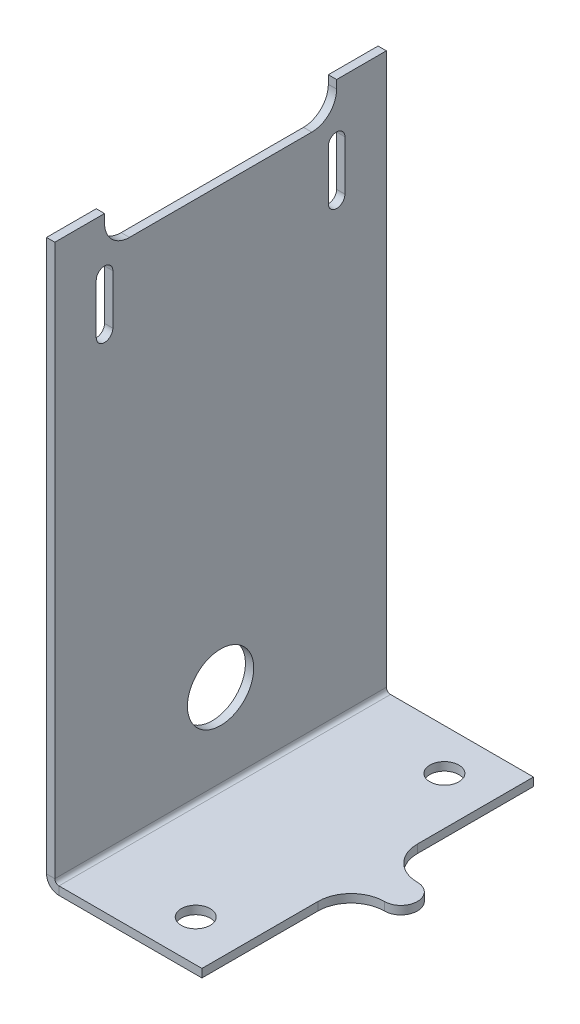
ISO-10303-21;
HEADER;
FILE_DESCRIPTION(('STEP AP214'),'2;1');
FILE_NAME('part.step','',(''),(''),'','','');
FILE_SCHEMA(('AUTOMOTIVE_DESIGN { 1 0 10303 214 1 1 1 1 }'));
ENDSEC;
DATA;
#1=APPLICATION_CONTEXT('core data for automotive mechanical design processes');
#2=APPLICATION_PROTOCOL_DEFINITION('international standard','automotive_design',2000,#1);
#3=PRODUCT_CONTEXT('',#1,'mechanical');
#4=PRODUCT('Part','Part','',(#3));
#5=PRODUCT_RELATED_PRODUCT_CATEGORY('part','',(#4));
#6=PRODUCT_DEFINITION_FORMATION('','',#4);
#7=PRODUCT_DEFINITION_CONTEXT('part definition',#1,'design');
#8=PRODUCT_DEFINITION('design','',#6,#7);
#9=PRODUCT_DEFINITION_SHAPE('','',#8);
#10=(LENGTH_UNIT() NAMED_UNIT(*) SI_UNIT(.MILLI.,.METRE.));
#11=(NAMED_UNIT(*) PLANE_ANGLE_UNIT() SI_UNIT($,.RADIAN.));
#12=(NAMED_UNIT(*) SI_UNIT($,.STERADIAN.) SOLID_ANGLE_UNIT());
#13=UNCERTAINTY_MEASURE_WITH_UNIT(LENGTH_MEASURE(1.E-05),#10,'distance_accuracy_value','');
#14=(GEOMETRIC_REPRESENTATION_CONTEXT(3) GLOBAL_UNCERTAINTY_ASSIGNED_CONTEXT((#13)) GLOBAL_UNIT_ASSIGNED_CONTEXT((#10,
#11,#12)) REPRESENTATION_CONTEXT('',''));
#15=CARTESIAN_POINT('',(0.,0.,0.));
#16=DIRECTION('',(0.,0.,1.));
#17=DIRECTION('',(1.,0.,0.));
#18=AXIS2_PLACEMENT_3D('',#15,#16,#17);
#19=CARTESIAN_POINT('',(37.30725,33.3375,0.));
#20=DIRECTION('',(-1.,0.,0.));
#21=DIRECTION('',(0.,0.,1.));
#22=AXIS2_PLACEMENT_3D('',#19,#20,#21);
#23=CYLINDRICAL_SURFACE('',#22,12.7);
#24=CARTESIAN_POINT('',(-41.275,33.3375,0.));
#25=DIRECTION('',(-1.,0.,0.));
#26=DIRECTION('',(0.,0.,1.));
#27=AXIS2_PLACEMENT_3D('',#24,#25,#26);
#28=CIRCLE('',#27,12.7);
#29=CARTESIAN_POINT('',(-41.275,33.3375,12.7));
#30=VERTEX_POINT('',#29);
#31=EDGE_CURVE('E384',#30,#30,#28,.T.);
#32=ORIENTED_EDGE('',*,*,#31,.T.);
#33=EDGE_LOOP('',(#32));
#34=FACE_BOUND('',#33,.T.);
#35=CARTESIAN_POINT('',(-38.1000000000002,33.3375,0.));
#36=DIRECTION('',(-1.,0.,0.));
#37=DIRECTION('',(0.,-1.,0.));
#38=AXIS2_PLACEMENT_3D('',#35,#36,#37);
#39=CIRCLE('',#38,12.7);
#40=CARTESIAN_POINT('',(-38.1000000000002,20.6375,0.));
#41=VERTEX_POINT('',#40);
#42=EDGE_CURVE('E326',#41,#41,#39,.F.);
#43=ORIENTED_EDGE('',*,*,#42,.T.);
#44=EDGE_LOOP('',(#43));
#45=FACE_BOUND('',#44,.T.);
#46=ADVANCED_FACE('F30',(#34,#45),#23,.F.);
#47=CARTESIAN_POINT('',(37.30725,173.101,-44.4499999999998));
#48=DIRECTION('',(-1.,0.,0.));
#49=DIRECTION('',(0.,0.,1.));
#50=AXIS2_PLACEMENT_3D('',#47,#48,#49);
#51=CYLINDRICAL_SURFACE('',#50,3.175);
#52=CARTESIAN_POINT('',(-38.1000000000002,173.101,-44.4499999999998));
#53=DIRECTION('',(-1.,0.,0.));
#54=DIRECTION('',(0.,-1.,0.));
#55=AXIS2_PLACEMENT_3D('',#52,#53,#54);
#56=CIRCLE('',#55,3.175);
#57=CARTESIAN_POINT('',(-38.1000000000002,173.101,-41.2749999999998));
#58=VERTEX_POINT('',#57);
#59=CARTESIAN_POINT('',(-38.1000000000002,173.101,-47.6249999999999));
#60=VERTEX_POINT('',#59);
#61=EDGE_CURVE('E323',#58,#60,#56,.F.);
#62=ORIENTED_EDGE('',*,*,#61,.T.);
#63=DIRECTION('',(-1.,0.,0.));
#64=VECTOR('',#63,1.);
#65=CARTESIAN_POINT('',(37.30725,173.101,-47.6249999999998));
#66=LINE('',#65,#64);
#67=CARTESIAN_POINT('',(-41.275,173.101,-47.6249999999998));
#68=VERTEX_POINT('',#67);
#69=EDGE_CURVE('E414',#60,#68,#66,.T.);
#70=ORIENTED_EDGE('',*,*,#69,.T.);
#71=CARTESIAN_POINT('',(-41.275,173.101,-44.4499999999998));
#72=DIRECTION('',(-1.,0.,0.));
#73=DIRECTION('',(0.,0.,1.));
#74=AXIS2_PLACEMENT_3D('',#71,#72,#73);
#75=CIRCLE('',#74,3.175);
#76=CARTESIAN_POINT('',(-41.275,173.101,-41.2749999999998));
#77=VERTEX_POINT('',#76);
#78=EDGE_CURVE('E381',#68,#77,#75,.T.);
#79=ORIENTED_EDGE('',*,*,#78,.T.);
#80=DIRECTION('',(-1.,0.,0.));
#81=VECTOR('',#80,1.);
#82=CARTESIAN_POINT('',(37.30725,173.101,-41.2749999999998));
#83=LINE('',#82,#81);
#84=EDGE_CURVE('E420',#58,#77,#83,.T.);
#85=ORIENTED_EDGE('',*,*,#84,.F.);
#86=EDGE_LOOP('',(#62,#70,#79,#85));
#87=FACE_BOUND('',#86,.T.);
#88=ADVANCED_FACE('F508',(#87),#51,.F.);
#89=CARTESIAN_POINT('',(37.30725,173.101,-41.2749999999998));
#90=DIRECTION('',(0.,0.,1.));
#91=DIRECTION('',(0.,-1.,0.));
#92=AXIS2_PLACEMENT_3D('',#89,#90,#91);
#93=PLANE('',#92);
#94=DIRECTION('',(0.,-1.,0.));
#95=VECTOR('',#94,1.);
#96=CARTESIAN_POINT('',(-38.1000000000002,173.101,-41.2749999999998));
#97=LINE('',#96,#95);
#98=CARTESIAN_POINT('',(-38.1000000000002,192.151,-41.2749999999998));
#99=VERTEX_POINT('',#98);
#100=EDGE_CURVE('E315',#99,#58,#97,.T.);
#101=ORIENTED_EDGE('',*,*,#100,.T.);
#102=ORIENTED_EDGE('',*,*,#84,.T.);
#103=DIRECTION('',(0.,1.,0.));
#104=VECTOR('',#103,1.);
#105=CARTESIAN_POINT('',(-41.275,173.101,-41.2749999999998));
#106=LINE('',#105,#104);
#107=CARTESIAN_POINT('',(-41.275,192.151,-41.2749999999998));
#108=VERTEX_POINT('',#107);
#109=EDGE_CURVE('E378',#77,#108,#106,.T.);
#110=ORIENTED_EDGE('',*,*,#109,.T.);
#111=DIRECTION('',(-1.,0.,0.));
#112=VECTOR('',#111,1.);
#113=CARTESIAN_POINT('',(37.30725,192.151,-41.2749999999998));
#114=LINE('',#113,#112);
#115=EDGE_CURVE('E417',#99,#108,#114,.T.);
#116=ORIENTED_EDGE('',*,*,#115,.F.);
#117=EDGE_LOOP('',(#101,#102,#110,#116));
#118=FACE_BOUND('',#117,.T.);
#119=ADVANCED_FACE('F504',(#118),#93,.F.);
#120=CARTESIAN_POINT('',(37.30725,192.151,-44.4499999999998));
#121=DIRECTION('',(-1.,0.,0.));
#122=DIRECTION('',(0.,0.,1.));
#123=AXIS2_PLACEMENT_3D('',#120,#121,#122);
#124=CYLINDRICAL_SURFACE('',#123,3.17500000000001);
#125=CARTESIAN_POINT('',(-38.1000000000002,192.151,-44.4499999999998));
#126=DIRECTION('',(-1.,0.,0.));
#127=DIRECTION('',(0.,-1.,0.));
#128=AXIS2_PLACEMENT_3D('',#125,#126,#127);
#129=CIRCLE('',#128,3.17500000000001);
#130=CARTESIAN_POINT('',(-38.1000000000002,192.151,-47.6249999999998));
#131=VERTEX_POINT('',#130);
#132=EDGE_CURVE('E317',#131,#99,#129,.F.);
#133=ORIENTED_EDGE('',*,*,#132,.T.);
#134=ORIENTED_EDGE('',*,*,#115,.T.);
#135=CARTESIAN_POINT('',(-41.275,192.151,-44.4499999999998));
#136=DIRECTION('',(-1.,0.,0.));
#137=DIRECTION('',(0.,0.,1.));
#138=AXIS2_PLACEMENT_3D('',#135,#136,#137);
#139=CIRCLE('',#138,3.17500000000001);
#140=CARTESIAN_POINT('',(-41.275,192.151,-47.6249999999999));
#141=VERTEX_POINT('',#140);
#142=EDGE_CURVE('E375',#108,#141,#139,.T.);
#143=ORIENTED_EDGE('',*,*,#142,.T.);
#144=DIRECTION('',(-1.,0.,0.));
#145=VECTOR('',#144,1.);
#146=CARTESIAN_POINT('',(37.30725,192.151,-47.6249999999998));
#147=LINE('',#146,#145);
#148=EDGE_CURVE('E411',#131,#141,#147,.T.);
#149=ORIENTED_EDGE('',*,*,#148,.F.);
#150=EDGE_LOOP('',(#133,#134,#143,#149));
#151=FACE_BOUND('',#150,.T.);
#152=ADVANCED_FACE('F500',(#151),#124,.F.);
#153=CARTESIAN_POINT('',(37.30725,192.151,-47.6249999999998));
#154=DIRECTION('',(0.,0.,-1.));
#155=DIRECTION('',(0.,1.,0.));
#156=AXIS2_PLACEMENT_3D('',#153,#154,#155);
#157=PLANE('',#156);
#158=DIRECTION('',(0.,1.,0.));
#159=VECTOR('',#158,1.);
#160=CARTESIAN_POINT('',(-38.1000000000002,192.151,-47.6249999999998));
#161=LINE('',#160,#159);
#162=EDGE_CURVE('E320',#60,#131,#161,.T.);
#163=ORIENTED_EDGE('',*,*,#162,.T.);
#164=ORIENTED_EDGE('',*,*,#148,.T.);
#165=DIRECTION('',(0.,-1.,0.));
#166=VECTOR('',#165,1.);
#167=CARTESIAN_POINT('',(-41.275,192.151,-47.6249999999998));
#168=LINE('',#167,#166);
#169=EDGE_CURVE('E373',#141,#68,#168,.T.);
#170=ORIENTED_EDGE('',*,*,#169,.T.);
#171=ORIENTED_EDGE('',*,*,#69,.F.);
#172=EDGE_LOOP('',(#163,#164,#170,#171));
#173=FACE_BOUND('',#172,.T.);
#174=ADVANCED_FACE('F496',(#173),#157,.F.);
#175=CARTESIAN_POINT('',(-41.275,1.58750000000013,287.45709349463));
#176=DIRECTION('',(1.,0.,0.));
#177=DIRECTION('',(0.,0.,-1.));
#178=AXIS2_PLACEMENT_3D('',#175,#176,#177);
#179=PLANE('',#178);
#180=DIRECTION('',(0.,1.,0.));
#181=VECTOR('',#180,1.);
#182=CARTESIAN_POINT('',(-41.275,173.101,47.6250000000002));
#183=LINE('',#182,#181);
#184=CARTESIAN_POINT('',(-41.275,173.101,47.6250000000001));
#185=VERTEX_POINT('',#184);
#186=CARTESIAN_POINT('',(-41.275,192.151,47.6250000000002));
#187=VERTEX_POINT('',#186);
#188=EDGE_CURVE('E367',#185,#187,#183,.T.);
#189=ORIENTED_EDGE('',*,*,#188,.F.);
#190=CARTESIAN_POINT('',(-41.275,173.101,44.4500000000001));
#191=DIRECTION('',(-1.,0.,0.));
#192=DIRECTION('',(0.,0.,1.));
#193=AXIS2_PLACEMENT_3D('',#190,#191,#192);
#194=CIRCLE('',#193,3.17500000000001);
#195=CARTESIAN_POINT('',(-41.275,173.101,41.2750000000001));
#196=VERTEX_POINT('',#195);
#197=EDGE_CURVE('E370',#196,#185,#194,.T.);
#198=ORIENTED_EDGE('',*,*,#197,.F.);
#199=DIRECTION('',(0.,-1.,0.));
#200=VECTOR('',#199,1.);
#201=CARTESIAN_POINT('',(-41.275,192.151,41.2750000000001));
#202=LINE('',#201,#200);
#203=CARTESIAN_POINT('',(-41.275,192.151,41.2750000000001));
#204=VERTEX_POINT('',#203);
#205=EDGE_CURVE('E355',#204,#196,#202,.T.);
#206=ORIENTED_EDGE('',*,*,#205,.F.);
#207=CARTESIAN_POINT('',(-41.275,192.151,44.4500000000002));
#208=DIRECTION('',(-1.,0.,0.));
#209=DIRECTION('',(0.,0.,1.));
#210=AXIS2_PLACEMENT_3D('',#207,#208,#209);
#211=CIRCLE('',#210,3.17500000000001);
#212=EDGE_CURVE('E362',#187,#204,#211,.T.);
#213=ORIENTED_EDGE('',*,*,#212,.F.);
#214=EDGE_LOOP('',(#189,#198,#206,#213));
#215=FACE_BOUND('',#214,.T.);
#216=ORIENTED_EDGE('',*,*,#169,.F.);
#217=ORIENTED_EDGE('',*,*,#142,.F.);
#218=ORIENTED_EDGE('',*,*,#109,.F.);
#219=ORIENTED_EDGE('',*,*,#78,.F.);
#220=EDGE_LOOP('',(#216,#217,#218,#219));
#221=FACE_BOUND('',#220,.T.);
#222=ORIENTED_EDGE('',*,*,#31,.F.);
#223=EDGE_LOOP('',(#222));
#224=FACE_BOUND('',#223,.T.);
#225=DIRECTION('',(0.,0.,-1.));
#226=VECTOR('',#225,1.);
#227=CARTESIAN_POINT('',(-41.275,212.725,287.45709349463));
#228=LINE('',#227,#226);
#229=CARTESIAN_POINT('',(-41.2749999999997,212.725,63.4999999999995));
#230=VERTEX_POINT('',#229);
#231=CARTESIAN_POINT('',(-41.275,212.725,44.45));
#232=VERTEX_POINT('',#231);
#233=EDGE_CURVE('E387',#230,#232,#228,.T.);
#234=ORIENTED_EDGE('',*,*,#233,.T.);
#235=DIRECTION('',(0.,-1.,0.));
#236=VECTOR('',#235,1.);
#237=CARTESIAN_POINT('',(-41.275,212.725,44.45));
#238=LINE('',#237,#236);
#239=CARTESIAN_POINT('',(-41.275,209.55,44.45));
#240=VERTEX_POINT('',#239);
#241=EDGE_CURVE('E390',#232,#240,#238,.T.);
#242=ORIENTED_EDGE('',*,*,#241,.T.);
#243=CARTESIAN_POINT('',(-41.275,209.55,34.925));
#244=DIRECTION('',(1.,0.,0.));
#245=DIRECTION('',(0.,0.,-1.));
#246=AXIS2_PLACEMENT_3D('',#243,#244,#245);
#247=CIRCLE('',#246,9.525);
#248=CARTESIAN_POINT('',(-41.275,200.025,34.925));
#249=VERTEX_POINT('',#248);
#250=EDGE_CURVE('E394',#240,#249,#247,.T.);
#251=ORIENTED_EDGE('',*,*,#250,.T.);
#252=DIRECTION('',(0.,0.,-1.));
#253=VECTOR('',#252,1.);
#254=CARTESIAN_POINT('',(-41.275,200.025,44.45));
#255=LINE('',#254,#253);
#256=CARTESIAN_POINT('',(-41.275,200.025,-34.925));
#257=VERTEX_POINT('',#256);
#258=EDGE_CURVE('E397',#249,#257,#255,.T.);
#259=ORIENTED_EDGE('',*,*,#258,.T.);
#260=CARTESIAN_POINT('',(-41.275,209.55,-34.925));
#261=DIRECTION('',(1.,0.,0.));
#262=DIRECTION('',(0.,0.,-1.));
#263=AXIS2_PLACEMENT_3D('',#260,#261,#262);
#264=CIRCLE('',#263,9.525);
#265=CARTESIAN_POINT('',(-41.275,209.55,-44.45));
#266=VERTEX_POINT('',#265);
#267=EDGE_CURVE('E400',#257,#266,#264,.T.);
#268=ORIENTED_EDGE('',*,*,#267,.T.);
#269=DIRECTION('',(0.,1.,0.));
#270=VECTOR('',#269,1.);
#271=CARTESIAN_POINT('',(-41.275,200.025,-44.45));
#272=LINE('',#271,#270);
#273=CARTESIAN_POINT('',(-41.275,212.725,-44.45));
#274=VERTEX_POINT('',#273);
#275=EDGE_CURVE('E45',#266,#274,#272,.T.);
#276=ORIENTED_EDGE('',*,*,#275,.T.);
#277=CARTESIAN_POINT('',(-41.275,212.725,-63.5000000000005));
#278=VERTEX_POINT('',#277);
#279=EDGE_CURVE('E391',#274,#278,#228,.T.);
#280=ORIENTED_EDGE('',*,*,#279,.T.);
#281=DIRECTION('',(0.,1.,0.));
#282=VECTOR('',#281,1.);
#283=CARTESIAN_POINT('',(-41.275,1.58750000000064,-63.5));
#284=LINE('',#283,#282);
#285=CARTESIAN_POINT('',(-41.2750000000001,1.58750000000013,-63.5000000000001));
#286=VERTEX_POINT('',#285);
#287=EDGE_CURVE('E404',#286,#278,#284,.T.);
#288=ORIENTED_EDGE('',*,*,#287,.F.);
#289=DIRECTION('',(0.,0.,-1.));
#290=VECTOR('',#289,1.);
#291=CARTESIAN_POINT('',(-41.275,1.58750000000013,287.45709349463));
#292=LINE('',#291,#290);
#293=CARTESIAN_POINT('',(-41.2750000000001,1.58750000000013,63.5));
#294=VERTEX_POINT('',#293);
#295=EDGE_CURVE('E226',#294,#286,#292,.T.);
#296=ORIENTED_EDGE('',*,*,#295,.F.);
#297=DIRECTION('',(0.,1.,0.));
#298=VECTOR('',#297,1.);
#299=CARTESIAN_POINT('',(-41.275,1.58749999999962,63.5));
#300=LINE('',#299,#298);
#301=EDGE_CURVE('E408',#294,#230,#300,.T.);
#302=ORIENTED_EDGE('',*,*,#301,.T.);
#303=EDGE_LOOP('',(#234,#242,#251,#259,#268,#276,#280,#288,#296,#302));
#304=FACE_BOUND('',#303,.T.);
#305=ADVANCED_FACE('F449',(#215,#221,#224,#304),#179,.F.);
#306=CARTESIAN_POINT('',(37.30725,173.101,44.4500000000001));
#307=DIRECTION('',(-1.,0.,0.));
#308=DIRECTION('',(0.,0.,1.));
#309=AXIS2_PLACEMENT_3D('',#306,#307,#308);
#310=CYLINDRICAL_SURFACE('',#309,3.17500000000001);
#311=CARTESIAN_POINT('',(-38.1000000000002,173.101,44.4500000000001));
#312=DIRECTION('',(-1.,0.,0.));
#313=DIRECTION('',(0.,-1.,0.));
#314=AXIS2_PLACEMENT_3D('',#311,#312,#313);
#315=CIRCLE('',#314,3.17500000000001);
#316=CARTESIAN_POINT('',(-38.1000000000002,173.101,47.6250000000002));
#317=VERTEX_POINT('',#316);
#318=CARTESIAN_POINT('',(-38.1000000000002,173.101,41.2750000000001));
#319=VERTEX_POINT('',#318);
#320=EDGE_CURVE('E306',#317,#319,#315,.F.);
#321=ORIENTED_EDGE('',*,*,#320,.T.);
#322=DIRECTION('',(-1.,0.,0.));
#323=VECTOR('',#322,1.);
#324=CARTESIAN_POINT('',(37.30725,173.101,41.2750000000001));
#325=LINE('',#324,#323);
#326=EDGE_CURVE('E357',#319,#196,#325,.T.);
#327=ORIENTED_EDGE('',*,*,#326,.T.);
#328=ORIENTED_EDGE('',*,*,#197,.T.);
#329=DIRECTION('',(-1.,0.,0.));
#330=VECTOR('',#329,1.);
#331=CARTESIAN_POINT('',(37.30725,173.101,47.6250000000002));
#332=LINE('',#331,#330);
#333=EDGE_CURVE('E365',#317,#185,#332,.T.);
#334=ORIENTED_EDGE('',*,*,#333,.F.);
#335=EDGE_LOOP('',(#321,#327,#328,#334));
#336=FACE_BOUND('',#335,.T.);
#337=ADVANCED_FACE('F489',(#336),#310,.F.);
#338=CARTESIAN_POINT('',(37.30725,173.101,47.6250000000002));
#339=DIRECTION('',(0.,0.,1.));
#340=DIRECTION('',(0.,-1.,0.));
#341=AXIS2_PLACEMENT_3D('',#338,#339,#340);
#342=PLANE('',#341);
#343=DIRECTION('',(0.,-1.,0.));
#344=VECTOR('',#343,1.);
#345=CARTESIAN_POINT('',(-38.1000000000002,173.101,47.6250000000002));
#346=LINE('',#345,#344);
#347=CARTESIAN_POINT('',(-38.1000000000002,192.151,47.6250000000002));
#348=VERTEX_POINT('',#347);
#349=EDGE_CURVE('E309',#348,#317,#346,.T.);
#350=ORIENTED_EDGE('',*,*,#349,.T.);
#351=ORIENTED_EDGE('',*,*,#333,.T.);
#352=ORIENTED_EDGE('',*,*,#188,.T.);
#353=DIRECTION('',(-1.,0.,0.));
#354=VECTOR('',#353,1.);
#355=CARTESIAN_POINT('',(37.30725,192.151,47.6250000000002));
#356=LINE('',#355,#354);
#357=EDGE_CURVE('E360',#348,#187,#356,.T.);
#358=ORIENTED_EDGE('',*,*,#357,.F.);
#359=EDGE_LOOP('',(#350,#351,#352,#358));
#360=FACE_BOUND('',#359,.T.);
#361=ADVANCED_FACE('F485',(#360),#342,.F.);
#362=CARTESIAN_POINT('',(37.30725,192.151,44.4500000000002));
#363=DIRECTION('',(-1.,0.,0.));
#364=DIRECTION('',(0.,0.,1.));
#365=AXIS2_PLACEMENT_3D('',#362,#363,#364);
#366=CYLINDRICAL_SURFACE('',#365,3.17500000000001);
#367=CARTESIAN_POINT('',(-38.1000000000002,192.151,44.4500000000002));
#368=DIRECTION('',(-1.,0.,0.));
#369=DIRECTION('',(0.,-1.,0.));
#370=AXIS2_PLACEMENT_3D('',#367,#368,#369);
#371=CIRCLE('',#370,3.17500000000001);
#372=CARTESIAN_POINT('',(-38.1000000000002,192.151,41.2750000000001));
#373=VERTEX_POINT('',#372);
#374=EDGE_CURVE('E312',#373,#348,#371,.F.);
#375=ORIENTED_EDGE('',*,*,#374,.T.);
#376=ORIENTED_EDGE('',*,*,#357,.T.);
#377=ORIENTED_EDGE('',*,*,#212,.T.);
#378=DIRECTION('',(-1.,0.,0.));
#379=VECTOR('',#378,1.);
#380=CARTESIAN_POINT('',(37.30725,192.151,41.2750000000001));
#381=LINE('',#380,#379);
#382=EDGE_CURVE('E353',#373,#204,#381,.T.);
#383=ORIENTED_EDGE('',*,*,#382,.F.);
#384=EDGE_LOOP('',(#375,#376,#377,#383));
#385=FACE_BOUND('',#384,.T.);
#386=ADVANCED_FACE('F476',(#385),#366,.F.);
#387=CARTESIAN_POINT('',(37.30725,192.151,41.2750000000001));
#388=DIRECTION('',(0.,0.,-1.));
#389=DIRECTION('',(0.,1.,0.));
#390=AXIS2_PLACEMENT_3D('',#387,#388,#389);
#391=PLANE('',#390);
#392=DIRECTION('',(0.,1.,0.));
#393=VECTOR('',#392,1.);
#394=CARTESIAN_POINT('',(-38.1000000000002,192.151,41.2750000000001));
#395=LINE('',#394,#393);
#396=EDGE_CURVE('E304',#319,#373,#395,.T.);
#397=ORIENTED_EDGE('',*,*,#396,.T.);
#398=ORIENTED_EDGE('',*,*,#382,.T.);
#399=ORIENTED_EDGE('',*,*,#205,.T.);
#400=ORIENTED_EDGE('',*,*,#326,.F.);
#401=EDGE_LOOP('',(#397,#398,#399,#400));
#402=FACE_BOUND('',#401,.T.);
#403=ADVANCED_FACE('F470',(#402),#391,.F.);
#404=CARTESIAN_POINT('',(-38.1000000000002,212.725,287.45709349463));
#405=DIRECTION('',(-1.,0.,0.));
#406=DIRECTION('',(0.,-1.,0.));
#407=AXIS2_PLACEMENT_3D('',#404,#405,#406);
#408=PLANE('',#407);
#409=ORIENTED_EDGE('',*,*,#396,.F.);
#410=ORIENTED_EDGE('',*,*,#320,.F.);
#411=ORIENTED_EDGE('',*,*,#349,.F.);
#412=ORIENTED_EDGE('',*,*,#374,.F.);
#413=EDGE_LOOP('',(#409,#410,#411,#412));
#414=FACE_BOUND('',#413,.T.);
#415=ORIENTED_EDGE('',*,*,#100,.F.);
#416=ORIENTED_EDGE('',*,*,#132,.F.);
#417=ORIENTED_EDGE('',*,*,#162,.F.);
#418=ORIENTED_EDGE('',*,*,#61,.F.);
#419=EDGE_LOOP('',(#415,#416,#417,#418));
#420=FACE_BOUND('',#419,.T.);
#421=ORIENTED_EDGE('',*,*,#42,.F.);
#422=EDGE_LOOP('',(#421));
#423=FACE_BOUND('',#422,.T.);
#424=DIRECTION('',(0.,-1.,0.));
#425=VECTOR('',#424,1.);
#426=CARTESIAN_POINT('',(-38.1000000000002,212.725,-44.45));
#427=LINE('',#426,#425);
#428=CARTESIAN_POINT('',(-38.1000000000002,212.725,-44.45));
#429=VERTEX_POINT('',#428);
#430=CARTESIAN_POINT('',(-38.1000000000002,209.55,-44.45));
#431=VERTEX_POINT('',#430);
#432=EDGE_CURVE('E329',#429,#431,#427,.T.);
#433=ORIENTED_EDGE('',*,*,#432,.T.);
#434=CARTESIAN_POINT('',(-38.1000000000002,209.55,-34.925));
#435=DIRECTION('',(-1.,0.,0.));
#436=DIRECTION('',(0.,-1.,0.));
#437=AXIS2_PLACEMENT_3D('',#434,#435,#436);
#438=CIRCLE('',#437,9.525);
#439=CARTESIAN_POINT('',(-38.1000000000002,200.025,-34.925));
#440=VERTEX_POINT('',#439);
#441=EDGE_CURVE('E51',#431,#440,#438,.T.);
#442=ORIENTED_EDGE('',*,*,#441,.T.);
#443=DIRECTION('',(0.,0.,1.));
#444=VECTOR('',#443,1.);
#445=CARTESIAN_POINT('',(-38.1000000000002,200.025,287.45709349463));
#446=LINE('',#445,#444);
#447=CARTESIAN_POINT('',(-38.1000000000002,200.025,34.925));
#448=VERTEX_POINT('',#447);
#449=EDGE_CURVE('E333',#440,#448,#446,.T.);
#450=ORIENTED_EDGE('',*,*,#449,.T.);
#451=CARTESIAN_POINT('',(-38.1000000000002,209.55,34.925));
#452=DIRECTION('',(-1.,0.,0.));
#453=DIRECTION('',(0.,-1.,0.));
#454=AXIS2_PLACEMENT_3D('',#451,#452,#453);
#455=CIRCLE('',#454,9.525);
#456=CARTESIAN_POINT('',(-38.1000000000002,209.55,44.45));
#457=VERTEX_POINT('',#456);
#458=EDGE_CURVE('E336',#448,#457,#455,.T.);
#459=ORIENTED_EDGE('',*,*,#458,.T.);
#460=DIRECTION('',(0.,1.,0.));
#461=VECTOR('',#460,1.);
#462=CARTESIAN_POINT('',(-38.1000000000002,212.725,44.45));
#463=LINE('',#462,#461);
#464=CARTESIAN_POINT('',(-38.1000000000002,212.725,44.45));
#465=VERTEX_POINT('',#464);
#466=EDGE_CURVE('E339',#457,#465,#463,.T.);
#467=ORIENTED_EDGE('',*,*,#466,.T.);
#468=DIRECTION('',(0.,0.,-1.));
#469=VECTOR('',#468,1.);
#470=CARTESIAN_POINT('',(-38.1000000000002,212.725,287.45709349463));
#471=LINE('',#470,#469);
#472=CARTESIAN_POINT('',(-38.0999999999999,212.725,63.4999999999995));
#473=VERTEX_POINT('',#472);
#474=EDGE_CURVE('E342',#473,#465,#471,.T.);
#475=ORIENTED_EDGE('',*,*,#474,.F.);
#476=DIRECTION('',(0.,-1.,0.));
#477=VECTOR('',#476,1.);
#478=CARTESIAN_POINT('',(-38.1000000000002,212.725,63.4999999999995));
#479=LINE('',#478,#477);
#480=CARTESIAN_POINT('',(-38.1000000000001,1.58750000000013,63.5));
#481=VERTEX_POINT('',#480);
#482=EDGE_CURVE('E344',#473,#481,#479,.T.);
#483=ORIENTED_EDGE('',*,*,#482,.T.);
#484=DIRECTION('',(0.,0.,-1.));
#485=VECTOR('',#484,1.);
#486=CARTESIAN_POINT('',(-38.1000000000001,1.58750000000013,287.45709349463));
#487=LINE('',#486,#485);
#488=CARTESIAN_POINT('',(-38.1000000000005,1.58750000000013,-63.5));
#489=VERTEX_POINT('',#488);
#490=EDGE_CURVE('E348',#481,#489,#487,.T.);
#491=ORIENTED_EDGE('',*,*,#490,.T.);
#492=DIRECTION('',(0.,-1.,0.));
#493=VECTOR('',#492,1.);
#494=CARTESIAN_POINT('',(-38.1000000000002,212.725000000001,-63.5000000000005));
#495=LINE('',#494,#493);
#496=CARTESIAN_POINT('',(-38.1000000000002,212.725,-63.5000000000005));
#497=VERTEX_POINT('',#496);
#498=EDGE_CURVE('E351',#497,#489,#495,.T.);
#499=ORIENTED_EDGE('',*,*,#498,.F.);
#500=EDGE_CURVE('E345',#429,#497,#471,.T.);
#501=ORIENTED_EDGE('',*,*,#500,.F.);
#502=EDGE_LOOP('',(#433,#442,#450,#459,#467,#475,#483,#491,#499,#501));
#503=FACE_BOUND('',#502,.T.);
#504=ADVANCED_FACE('F458',(#414,#420,#423,#503),#408,.F.);
#505=CARTESIAN_POINT('',(454.680047916918,212.725,-44.45));
#506=DIRECTION('',(0.,0.,-1.));
#507=DIRECTION('',(0.,1.,0.));
#508=AXIS2_PLACEMENT_3D('',#505,#506,#507);
#509=PLANE('',#508);
#510=DIRECTION('',(-1.,0.,0.));
#511=VECTOR('',#510,1.);
#512=CARTESIAN_POINT('',(454.680047916918,212.725,-44.45));
#513=LINE('',#512,#511);
#514=EDGE_CURVE('E423',#429,#274,#513,.T.);
#515=ORIENTED_EDGE('',*,*,#514,.T.);
#516=ORIENTED_EDGE('',*,*,#275,.F.);
#517=DIRECTION('',(-1.,0.,0.));
#518=VECTOR('',#517,1.);
#519=CARTESIAN_POINT('',(454.680047916918,209.55,-44.45));
#520=LINE('',#519,#518);
#521=EDGE_CURVE('E11',#431,#266,#520,.T.);
#522=ORIENTED_EDGE('',*,*,#521,.F.);
#523=ORIENTED_EDGE('',*,*,#432,.F.);
#524=EDGE_LOOP('',(#515,#516,#522,#523));
#525=FACE_BOUND('',#524,.T.);
#526=ADVANCED_FACE('F32',(#525),#509,.F.);
#527=CARTESIAN_POINT('',(454.680047916918,209.55,-34.925));
#528=DIRECTION('',(-1.,0.,0.));
#529=DIRECTION('',(0.,-1.,0.));
#530=AXIS2_PLACEMENT_3D('',#527,#528,#529);
#531=CYLINDRICAL_SURFACE('',#530,9.525);
#532=ORIENTED_EDGE('',*,*,#521,.T.);
#533=ORIENTED_EDGE('',*,*,#267,.F.);
#534=DIRECTION('',(-1.,0.,0.));
#535=VECTOR('',#534,1.);
#536=CARTESIAN_POINT('',(454.680047916918,200.025,-34.925));
#537=LINE('',#536,#535);
#538=EDGE_CURVE('E38',#440,#257,#537,.T.);
#539=ORIENTED_EDGE('',*,*,#538,.F.);
#540=ORIENTED_EDGE('',*,*,#441,.F.);
#541=EDGE_LOOP('',(#532,#533,#539,#540));
#542=FACE_BOUND('',#541,.T.);
#543=ADVANCED_FACE('F462',(#542),#531,.F.);
#544=CARTESIAN_POINT('',(454.680047916918,200.025,287.45709349463));
#545=DIRECTION('',(0.,-1.,0.));
#546=DIRECTION('',(1.,0.,0.));
#547=AXIS2_PLACEMENT_3D('',#544,#545,#546);
#548=PLANE('',#547);
#549=ORIENTED_EDGE('',*,*,#538,.T.);
#550=ORIENTED_EDGE('',*,*,#258,.F.);
#551=DIRECTION('',(-1.,0.,0.));
#552=VECTOR('',#551,1.);
#553=CARTESIAN_POINT('',(454.680047916918,200.025,34.925));
#554=LINE('',#553,#552);
#555=EDGE_CURVE('E442',#448,#249,#554,.T.);
#556=ORIENTED_EDGE('',*,*,#555,.F.);
#557=ORIENTED_EDGE('',*,*,#449,.F.);
#558=EDGE_LOOP('',(#549,#550,#556,#557));
#559=FACE_BOUND('',#558,.T.);
#560=ADVANCED_FACE('F446',(#559),#548,.F.);
#561=CARTESIAN_POINT('',(454.680047916918,209.55,34.925));
#562=DIRECTION('',(-1.,0.,0.));
#563=DIRECTION('',(0.,-1.,0.));
#564=AXIS2_PLACEMENT_3D('',#561,#562,#563);
#565=CYLINDRICAL_SURFACE('',#564,9.525);
#566=ORIENTED_EDGE('',*,*,#555,.T.);
#567=ORIENTED_EDGE('',*,*,#250,.F.);
#568=DIRECTION('',(-1.,0.,0.));
#569=VECTOR('',#568,1.);
#570=CARTESIAN_POINT('',(454.680047916918,209.55,44.45));
#571=LINE('',#570,#569);
#572=EDGE_CURVE('E439',#457,#240,#571,.T.);
#573=ORIENTED_EDGE('',*,*,#572,.F.);
#574=ORIENTED_EDGE('',*,*,#458,.F.);
#575=EDGE_LOOP('',(#566,#567,#573,#574));
#576=FACE_BOUND('',#575,.T.);
#577=ADVANCED_FACE('F452',(#576),#565,.F.);
#578=CARTESIAN_POINT('',(454.680047916918,212.725,44.45));
#579=DIRECTION('',(0.,0.,1.));
#580=DIRECTION('',(0.,-1.,0.));
#581=AXIS2_PLACEMENT_3D('',#578,#579,#580);
#582=PLANE('',#581);
#583=ORIENTED_EDGE('',*,*,#572,.T.);
#584=ORIENTED_EDGE('',*,*,#241,.F.);
#585=DIRECTION('',(-1.,0.,0.));
#586=VECTOR('',#585,1.);
#587=CARTESIAN_POINT('',(454.680047916918,212.725,44.45));
#588=LINE('',#587,#586);
#589=EDGE_CURVE('E436',#465,#232,#588,.T.);
#590=ORIENTED_EDGE('',*,*,#589,.F.);
#591=ORIENTED_EDGE('',*,*,#466,.F.);
#592=EDGE_LOOP('',(#583,#584,#590,#591));
#593=FACE_BOUND('',#592,.T.);
#594=ADVANCED_FACE('F454',(#593),#582,.F.);
#595=CARTESIAN_POINT('',(454.680047916918,212.725,287.45709349463));
#596=DIRECTION('',(0.,1.,0.));
#597=DIRECTION('',(-1.,0.,0.));
#598=AXIS2_PLACEMENT_3D('',#595,#596,#597);
#599=PLANE('',#598);
#600=ORIENTED_EDGE('',*,*,#233,.F.);
#601=DIRECTION('',(-1.,0.,0.));
#602=VECTOR('',#601,1.);
#603=CARTESIAN_POINT('',(454.680047916918,212.725,63.4999999999995));
#604=LINE('',#603,#602);
#605=EDGE_CURVE('E433',#473,#230,#604,.T.);
#606=ORIENTED_EDGE('',*,*,#605,.F.);
#607=ORIENTED_EDGE('',*,*,#474,.T.);
#608=ORIENTED_EDGE('',*,*,#589,.T.);
#609=EDGE_LOOP('',(#600,#606,#607,#608));
#610=FACE_BOUND('',#609,.T.);
#611=ADVANCED_FACE('F522',(#610),#599,.T.);
#612=CARTESIAN_POINT('',(454.680047916918,212.725,63.4999999999995));
#613=DIRECTION('',(0.,0.,-1.));
#614=DIRECTION('',(0.,1.,0.));
#615=AXIS2_PLACEMENT_3D('',#612,#613,#614);
#616=PLANE('',#615);
#617=ORIENTED_EDGE('',*,*,#605,.T.);
#618=ORIENTED_EDGE('',*,*,#301,.F.);
#619=DIRECTION('',(-1.,0.,0.));
#620=VECTOR('',#619,1.);
#621=CARTESIAN_POINT('',(454.680047916918,1.58750000000019,63.5));
#622=LINE('',#621,#620);
#623=EDGE_CURVE('E430',#481,#294,#622,.T.);
#624=ORIENTED_EDGE('',*,*,#623,.F.);
#625=ORIENTED_EDGE('',*,*,#482,.F.);
#626=EDGE_LOOP('',(#617,#618,#624,#625));
#627=FACE_BOUND('',#626,.T.);
#628=ADVANCED_FACE('F525',(#627),#616,.F.);
#629=CARTESIAN_POINT('',(454.680047916918,212.725000000001,-63.5000000000005));
#630=DIRECTION('',(0.,0.,-1.));
#631=DIRECTION('',(0.,1.,0.));
#632=AXIS2_PLACEMENT_3D('',#629,#630,#631);
#633=PLANE('',#632);
#634=ORIENTED_EDGE('',*,*,#287,.T.);
#635=DIRECTION('',(-1.,0.,0.));
#636=VECTOR('',#635,1.);
#637=CARTESIAN_POINT('',(454.680047916918,212.725,-63.5000000000005));
#638=LINE('',#637,#636);
#639=EDGE_CURVE('E425',#497,#278,#638,.T.);
#640=ORIENTED_EDGE('',*,*,#639,.F.);
#641=ORIENTED_EDGE('',*,*,#498,.T.);
#642=DIRECTION('',(-1.,0.,0.));
#643=VECTOR('',#642,1.);
#644=CARTESIAN_POINT('',(454.680047916918,1.58750000000019,-63.5));
#645=LINE('',#644,#643);
#646=EDGE_CURVE('E427',#489,#286,#645,.T.);
#647=ORIENTED_EDGE('',*,*,#646,.T.);
#648=EDGE_LOOP('',(#634,#640,#641,#647));
#649=FACE_BOUND('',#648,.T.);
#650=ADVANCED_FACE('F520',(#649),#633,.T.);
#651=ORIENTED_EDGE('',*,*,#279,.F.);
#652=ORIENTED_EDGE('',*,*,#514,.F.);
#653=ORIENTED_EDGE('',*,*,#500,.T.);
#654=ORIENTED_EDGE('',*,*,#639,.T.);
#655=EDGE_LOOP('',(#651,#652,#653,#654));
#656=FACE_BOUND('',#655,.T.);
#657=ADVANCED_FACE('F516',(#656),#599,.T.);
#658=CARTESIAN_POINT('',(18.2562499999992,293.790454927062,287.45709349463));
#659=DIRECTION('',(-1.,0.,0.));
#660=DIRECTION('',(0.,-1.,0.));
#661=AXIS2_PLACEMENT_3D('',#658,#659,#660);
#662=PLANE('',#661);
#663=DIRECTION('',(0.,-1.,0.));
#664=VECTOR('',#663,1.);
#665=CARTESIAN_POINT('',(18.2562499999992,293.790454927062,-19.05));
#666=LINE('',#665,#664);
#667=CARTESIAN_POINT('',(18.25625,1.11022302462516E-13,-19.05));
#668=VERTEX_POINT('',#667);
#669=CARTESIAN_POINT('',(18.25625,-3.17499999999987,-19.05));
#670=VERTEX_POINT('',#669);
#671=EDGE_CURVE('E215',#668,#670,#666,.T.);
#672=ORIENTED_EDGE('',*,*,#671,.T.);
#673=DIRECTION('',(0.,0.,-1.));
#674=VECTOR('',#673,1.);
#675=CARTESIAN_POINT('',(18.25625,-3.17499999999986,287.45709349463));
#676=LINE('',#675,#674);
#677=CARTESIAN_POINT('',(18.25625,-3.17499999999986,-63.5));
#678=VERTEX_POINT('',#677);
#679=EDGE_CURVE('E283',#670,#678,#676,.T.);
#680=ORIENTED_EDGE('',*,*,#679,.T.);
#681=DIRECTION('',(0.,-1.,0.));
#682=VECTOR('',#681,1.);
#683=CARTESIAN_POINT('',(18.2562499999992,293.790454927062,-63.5));
#684=LINE('',#683,#682);
#685=CARTESIAN_POINT('',(18.25625,0.,-63.5));
#686=VERTEX_POINT('',#685);
#687=EDGE_CURVE('E242',#686,#678,#684,.T.);
#688=ORIENTED_EDGE('',*,*,#687,.F.);
#689=DIRECTION('',(0.,0.,-1.));
#690=VECTOR('',#689,1.);
#691=CARTESIAN_POINT('',(18.25625,1.37175947684254E-13,287.45709349463));
#692=LINE('',#691,#690);
#693=EDGE_CURVE('E261',#668,#686,#692,.T.);
#694=ORIENTED_EDGE('',*,*,#693,.F.);
#695=EDGE_LOOP('',(#672,#680,#688,#694));
#696=FACE_BOUND('',#695,.T.);
#697=ADVANCED_FACE('F519',(#696),#662,.F.);
#698=CARTESIAN_POINT('',(30.9562499999992,293.790454927062,-19.05));
#699=DIRECTION('',(0.,-1.,0.));
#700=DIRECTION('',(1.,0.,0.));
#701=AXIS2_PLACEMENT_3D('',#698,#699,#700);
#702=CYLINDRICAL_SURFACE('',#701,12.7);
#703=CARTESIAN_POINT('',(30.95625,-3.1749999999999,-19.05));
#704=DIRECTION('',(0.,1.,0.));
#705=DIRECTION('',(-1.,0.,0.));
#706=AXIS2_PLACEMENT_3D('',#703,#704,#705);
#707=CIRCLE('',#706,12.7);
#708=CARTESIAN_POINT('',(30.95625,-3.17499999999987,-6.35));
#709=VERTEX_POINT('',#708);
#710=EDGE_CURVE('E238',#670,#709,#707,.T.);
#711=ORIENTED_EDGE('',*,*,#710,.F.);
#712=ORIENTED_EDGE('',*,*,#671,.F.);
#713=CARTESIAN_POINT('',(30.95625,1.03649727689614E-13,-19.05));
#714=DIRECTION('',(0.,1.,0.));
#715=DIRECTION('',(-1.,0.,0.));
#716=AXIS2_PLACEMENT_3D('',#713,#714,#715);
#717=CIRCLE('',#716,12.7);
#718=CARTESIAN_POINT('',(30.95625,2.22044604925031E-13,-6.35));
#719=VERTEX_POINT('',#718);
#720=EDGE_CURVE('E299',#668,#719,#717,.T.);
#721=ORIENTED_EDGE('',*,*,#720,.T.);
#722=DIRECTION('',(0.,-1.,0.));
#723=VECTOR('',#722,1.);
#724=CARTESIAN_POINT('',(30.9562499999992,293.790454927062,-6.35));
#725=LINE('',#724,#723);
#726=EDGE_CURVE('E296',#719,#709,#725,.T.);
#727=ORIENTED_EDGE('',*,*,#726,.T.);
#728=EDGE_LOOP('',(#711,#712,#721,#727));
#729=FACE_BOUND('',#728,.T.);
#730=ADVANCED_FACE('F565',(#729),#702,.F.);
#731=CARTESIAN_POINT('',(30.9562499999992,293.790454927062,0.));
#732=DIRECTION('',(0.,-1.,0.));
#733=DIRECTION('',(1.,0.,0.));
#734=AXIS2_PLACEMENT_3D('',#731,#732,#733);
#735=CYLINDRICAL_SURFACE('',#734,6.35);
#736=CARTESIAN_POINT('',(30.95625,-3.1749999999999,0.));
#737=DIRECTION('',(0.,-1.,0.));
#738=DIRECTION('',(1.,0.,0.));
#739=AXIS2_PLACEMENT_3D('',#736,#737,#738);
#740=CIRCLE('',#739,6.35);
#741=CARTESIAN_POINT('',(30.95625,-3.17499999999987,6.35));
#742=VERTEX_POINT('',#741);
#743=EDGE_CURVE('E249',#709,#742,#740,.T.);
#744=ORIENTED_EDGE('',*,*,#743,.F.);
#745=ORIENTED_EDGE('',*,*,#726,.F.);
#746=CARTESIAN_POINT('',(30.95625,1.03649727689614E-13,0.));
#747=DIRECTION('',(0.,-1.,0.));
#748=DIRECTION('',(1.,0.,0.));
#749=AXIS2_PLACEMENT_3D('',#746,#747,#748);
#750=CIRCLE('',#749,6.35);
#751=CARTESIAN_POINT('',(30.95625,1.66533453693773E-13,6.35));
#752=VERTEX_POINT('',#751);
#753=EDGE_CURVE('E294',#719,#752,#750,.T.);
#754=ORIENTED_EDGE('',*,*,#753,.T.);
#755=DIRECTION('',(0.,-1.,0.));
#756=VECTOR('',#755,1.);
#757=CARTESIAN_POINT('',(30.9562499999992,293.790454927062,6.35));
#758=LINE('',#757,#756);
#759=EDGE_CURVE('E291',#752,#742,#758,.T.);
#760=ORIENTED_EDGE('',*,*,#759,.T.);
#761=EDGE_LOOP('',(#744,#745,#754,#760));
#762=FACE_BOUND('',#761,.T.);
#763=ADVANCED_FACE('F574',(#762),#735,.T.);
#764=CARTESIAN_POINT('',(30.9562499999992,293.790454927062,19.05));
#765=DIRECTION('',(0.,-1.,0.));
#766=DIRECTION('',(1.,0.,0.));
#767=AXIS2_PLACEMENT_3D('',#764,#765,#766);
#768=CYLINDRICAL_SURFACE('',#767,12.7);
#769=CARTESIAN_POINT('',(30.95625,-3.1749999999999,19.05));
#770=DIRECTION('',(0.,1.,0.));
#771=DIRECTION('',(1.,0.,0.));
#772=AXIS2_PLACEMENT_3D('',#769,#770,#771);
#773=CIRCLE('',#772,12.7);
#774=CARTESIAN_POINT('',(18.25625,-3.17499999999987,19.05));
#775=VERTEX_POINT('',#774);
#776=EDGE_CURVE('E245',#742,#775,#773,.T.);
#777=ORIENTED_EDGE('',*,*,#776,.F.);
#778=ORIENTED_EDGE('',*,*,#759,.F.);
#779=CARTESIAN_POINT('',(30.95625,1.03649727689614E-13,19.05));
#780=DIRECTION('',(0.,1.,0.));
#781=DIRECTION('',(1.,0.,0.));
#782=AXIS2_PLACEMENT_3D('',#779,#780,#781);
#783=CIRCLE('',#782,12.7);
#784=CARTESIAN_POINT('',(18.25625,2.22044604925031E-13,19.05));
#785=VERTEX_POINT('',#784);
#786=EDGE_CURVE('E289',#752,#785,#783,.T.);
#787=ORIENTED_EDGE('',*,*,#786,.T.);
#788=DIRECTION('',(0.,-1.,0.));
#789=VECTOR('',#788,1.);
#790=CARTESIAN_POINT('',(18.2562499999992,293.790454927062,19.05));
#791=LINE('',#790,#789);
#792=EDGE_CURVE('E286',#785,#775,#791,.T.);
#793=ORIENTED_EDGE('',*,*,#792,.T.);
#794=EDGE_LOOP('',(#777,#778,#787,#793));
#795=FACE_BOUND('',#794,.T.);
#796=ADVANCED_FACE('F582',(#795),#768,.F.);
#797=DIRECTION('',(0.,-1.,0.));
#798=VECTOR('',#797,1.);
#799=CARTESIAN_POINT('',(18.2562499999992,293.790454927062,63.5));
#800=LINE('',#799,#798);
#801=CARTESIAN_POINT('',(18.25625,1.11022302462516E-13,63.5));
#802=VERTEX_POINT('',#801);
#803=CARTESIAN_POINT('',(18.25625,-3.17499999999987,63.5));
#804=VERTEX_POINT('',#803);
#805=EDGE_CURVE('E282',#802,#804,#800,.T.);
#806=ORIENTED_EDGE('',*,*,#805,.T.);
#807=EDGE_CURVE('E280',#804,#775,#676,.T.);
#808=ORIENTED_EDGE('',*,*,#807,.T.);
#809=ORIENTED_EDGE('',*,*,#792,.F.);
#810=EDGE_CURVE('E262',#802,#785,#692,.T.);
#811=ORIENTED_EDGE('',*,*,#810,.F.);
#812=EDGE_LOOP('',(#806,#808,#809,#811));
#813=FACE_BOUND('',#812,.T.);
#814=ADVANCED_FACE('F568',(#813),#662,.F.);
#815=CARTESIAN_POINT('',(2.14063364521142E-13,212.726,-47.625));
#816=DIRECTION('',(0.,-1.,0.));
#817=DIRECTION('',(1.,0.,0.));
#818=AXIS2_PLACEMENT_3D('',#815,#816,#817);
#819=CYLINDRICAL_SURFACE('',#818,5.55625);
#820=CARTESIAN_POINT('',(0.,-3.17499999999986,-47.625));
#821=DIRECTION('',(0.,-1.,0.));
#822=DIRECTION('',(1.,0.,0.));
#823=AXIS2_PLACEMENT_3D('',#820,#821,#822);
#824=CIRCLE('',#823,5.55625);
#825=CARTESIAN_POINT('',(5.55624999999999,-3.17499999999987,-47.625));
#826=VERTEX_POINT('',#825);
#827=EDGE_CURVE('E277',#826,#826,#824,.T.);
#828=ORIENTED_EDGE('',*,*,#827,.T.);
#829=EDGE_LOOP('',(#828));
#830=FACE_BOUND('',#829,.T.);
#831=CARTESIAN_POINT('',(0.,0.,-47.625));
#832=DIRECTION('',(0.,-1.,0.));
#833=DIRECTION('',(1.,0.,0.));
#834=AXIS2_PLACEMENT_3D('',#831,#832,#833);
#835=CIRCLE('',#834,5.55625);
#836=CARTESIAN_POINT('',(5.55625,0.,-47.625));
#837=VERTEX_POINT('',#836);
#838=EDGE_CURVE('E274',#837,#837,#835,.F.);
#839=ORIENTED_EDGE('',*,*,#838,.T.);
#840=EDGE_LOOP('',(#839));
#841=FACE_BOUND('',#840,.T.);
#842=ADVANCED_FACE('F597',(#830,#841),#819,.F.);
#843=CARTESIAN_POINT('',(2.19267534949072E-13,212.726,47.625));
#844=DIRECTION('',(0.,-1.,0.));
#845=DIRECTION('',(1.,0.,0.));
#846=AXIS2_PLACEMENT_3D('',#843,#844,#845);
#847=CYLINDRICAL_SURFACE('',#846,5.55625);
#848=CARTESIAN_POINT('',(0.,-3.17499999999986,47.625));
#849=DIRECTION('',(0.,-1.,0.));
#850=DIRECTION('',(1.,0.,0.));
#851=AXIS2_PLACEMENT_3D('',#848,#849,#850);
#852=CIRCLE('',#851,5.55625);
#853=CARTESIAN_POINT('',(5.55625,-3.17499999999987,47.625));
#854=VERTEX_POINT('',#853);
#855=EDGE_CURVE('E271',#854,#854,#852,.T.);
#856=ORIENTED_EDGE('',*,*,#855,.T.);
#857=EDGE_LOOP('',(#856));
#858=FACE_BOUND('',#857,.T.);
#859=CARTESIAN_POINT('',(0.,0.,47.625));
#860=DIRECTION('',(0.,-1.,0.));
#861=DIRECTION('',(1.,0.,0.));
#862=AXIS2_PLACEMENT_3D('',#859,#860,#861);
#863=CIRCLE('',#862,5.55625);
#864=CARTESIAN_POINT('',(5.55625,0.,47.625));
#865=VERTEX_POINT('',#864);
#866=EDGE_CURVE('E268',#865,#865,#863,.F.);
#867=ORIENTED_EDGE('',*,*,#866,.T.);
#868=EDGE_LOOP('',(#867));
#869=FACE_BOUND('',#868,.T.);
#870=ADVANCED_FACE('F604',(#858,#869),#847,.F.);
#871=CARTESIAN_POINT('',(18.25625,1.37175947684254E-13,287.45709349463));
#872=DIRECTION('',(0.,-1.,0.));
#873=DIRECTION('',(1.,0.,0.));
#874=AXIS2_PLACEMENT_3D('',#871,#872,#873);
#875=PLANE('',#874);
#876=ORIENTED_EDGE('',*,*,#866,.F.);
#877=EDGE_LOOP('',(#876));
#878=FACE_BOUND('',#877,.T.);
#879=ORIENTED_EDGE('',*,*,#838,.F.);
#880=EDGE_LOOP('',(#879));
#881=FACE_BOUND('',#880,.T.);
#882=DIRECTION('',(0.,0.,-1.));
#883=VECTOR('',#882,1.);
#884=CARTESIAN_POINT('',(-36.5125,0.,287.45709349463));
#885=LINE('',#884,#883);
#886=CARTESIAN_POINT('',(-36.5125,0.,63.4999999999999));
#887=VERTEX_POINT('',#886);
#888=CARTESIAN_POINT('',(-36.5125,0.,-63.5000000000001));
#889=VERTEX_POINT('',#888);
#890=EDGE_CURVE('E216',#887,#889,#885,.T.);
#891=ORIENTED_EDGE('',*,*,#890,.F.);
#892=DIRECTION('',(1.,0.,0.));
#893=VECTOR('',#892,1.);
#894=CARTESIAN_POINT('',(18.25625,1.37175947684254E-13,63.5));
#895=LINE('',#894,#893);
#896=EDGE_CURVE('E265',#887,#802,#895,.T.);
#897=ORIENTED_EDGE('',*,*,#896,.T.);
#898=ORIENTED_EDGE('',*,*,#810,.T.);
#899=ORIENTED_EDGE('',*,*,#786,.F.);
#900=ORIENTED_EDGE('',*,*,#753,.F.);
#901=ORIENTED_EDGE('',*,*,#720,.F.);
#902=ORIENTED_EDGE('',*,*,#693,.T.);
#903=DIRECTION('',(1.,0.,0.));
#904=VECTOR('',#903,1.);
#905=CARTESIAN_POINT('',(18.25625,1.37175947684254E-13,-63.5));
#906=LINE('',#905,#904);
#907=EDGE_CURVE('E244',#889,#686,#906,.T.);
#908=ORIENTED_EDGE('',*,*,#907,.F.);
#909=EDGE_LOOP('',(#891,#897,#898,#899,#900,#901,#902,#908));
#910=FACE_BOUND('',#909,.T.);
#911=ADVANCED_FACE('F612',(#878,#881,#910),#875,.F.);
#912=CARTESIAN_POINT('',(18.2562499999992,293.790454927062,63.5));
#913=DIRECTION('',(0.,0.,-1.));
#914=DIRECTION('',(-1.,0.,0.));
#915=AXIS2_PLACEMENT_3D('',#912,#913,#914);
#916=PLANE('',#915);
#917=DIRECTION('',(0.,-1.,0.));
#918=VECTOR('',#917,1.);
#919=CARTESIAN_POINT('',(-36.5125000000008,293.790454927062,63.5));
#920=LINE('',#919,#918);
#921=CARTESIAN_POINT('',(-36.5125,-3.17499999999987,63.5));
#922=VERTEX_POINT('',#921);
#923=EDGE_CURVE('E258',#887,#922,#920,.T.);
#924=ORIENTED_EDGE('',*,*,#923,.T.);
#925=DIRECTION('',(-1.,0.,0.));
#926=VECTOR('',#925,1.);
#927=CARTESIAN_POINT('',(18.25625,-3.17499999999986,63.5));
#928=LINE('',#927,#926);
#929=EDGE_CURVE('E237',#804,#922,#928,.T.);
#930=ORIENTED_EDGE('',*,*,#929,.F.);
#931=ORIENTED_EDGE('',*,*,#805,.F.);
#932=ORIENTED_EDGE('',*,*,#896,.F.);
#933=EDGE_LOOP('',(#924,#930,#931,#932));
#934=FACE_BOUND('',#933,.T.);
#935=ADVANCED_FACE('F620',(#934),#916,.F.);
#936=CARTESIAN_POINT('',(18.25625,-3.17499999999986,287.45709349463));
#937=DIRECTION('',(0.,1.,0.));
#938=DIRECTION('',(-1.,0.,0.));
#939=AXIS2_PLACEMENT_3D('',#936,#937,#938);
#940=PLANE('',#939);
#941=ORIENTED_EDGE('',*,*,#855,.F.);
#942=EDGE_LOOP('',(#941));
#943=FACE_BOUND('',#942,.T.);
#944=ORIENTED_EDGE('',*,*,#827,.F.);
#945=EDGE_LOOP('',(#944));
#946=FACE_BOUND('',#945,.T.);
#947=ORIENTED_EDGE('',*,*,#807,.F.);
#948=ORIENTED_EDGE('',*,*,#929,.T.);
#949=DIRECTION('',(0.,0.,-1.));
#950=VECTOR('',#949,1.);
#951=CARTESIAN_POINT('',(-36.5125,-3.17499999999987,287.45709349463));
#952=LINE('',#951,#950);
#953=CARTESIAN_POINT('',(-36.5125,-3.17500000000001,-63.5000000000001));
#954=VERTEX_POINT('',#953);
#955=EDGE_CURVE('E223',#922,#954,#952,.T.);
#956=ORIENTED_EDGE('',*,*,#955,.T.);
#957=DIRECTION('',(-1.,0.,0.));
#958=VECTOR('',#957,1.);
#959=CARTESIAN_POINT('',(18.25625,-3.17499999999986,-63.5));
#960=LINE('',#959,#958);
#961=EDGE_CURVE('E236',#678,#954,#960,.T.);
#962=ORIENTED_EDGE('',*,*,#961,.F.);
#963=ORIENTED_EDGE('',*,*,#679,.F.);
#964=ORIENTED_EDGE('',*,*,#710,.T.);
#965=ORIENTED_EDGE('',*,*,#743,.T.);
#966=ORIENTED_EDGE('',*,*,#776,.T.);
#967=EDGE_LOOP('',(#947,#948,#956,#962,#963,#964,#965,#966));
#968=FACE_BOUND('',#967,.T.);
#969=ADVANCED_FACE('F234',(#943,#946,#968),#940,.F.);
#970=CARTESIAN_POINT('',(18.2562499999992,293.790454927062,-63.5));
#971=DIRECTION('',(0.,0.,-1.));
#972=DIRECTION('',(-1.,0.,0.));
#973=AXIS2_PLACEMENT_3D('',#970,#971,#972);
#974=PLANE('',#973);
#975=ORIENTED_EDGE('',*,*,#961,.T.);
#976=DIRECTION('',(0.,-1.,0.));
#977=VECTOR('',#976,1.);
#978=CARTESIAN_POINT('',(-36.5125000000008,293.790454927062,-63.5));
#979=LINE('',#978,#977);
#980=EDGE_CURVE('E204',#889,#954,#979,.T.);
#981=ORIENTED_EDGE('',*,*,#980,.F.);
#982=ORIENTED_EDGE('',*,*,#907,.T.);
#983=ORIENTED_EDGE('',*,*,#687,.T.);
#984=EDGE_LOOP('',(#975,#981,#982,#983));
#985=FACE_BOUND('',#984,.T.);
#986=ADVANCED_FACE('F240',(#985),#974,.T.);
#987=CARTESIAN_POINT('',(-36.5125,1.58750000000013,-63.5));
#988=DIRECTION('',(0.,0.,-1.));
#989=DIRECTION('',(-1.,0.,0.));
#990=AXIS2_PLACEMENT_3D('',#987,#988,#989);
#991=PLANE('',#990);
#992=ORIENTED_EDGE('',*,*,#646,.F.);
#993=CARTESIAN_POINT('',(-36.5125,1.58750000000013,-63.5000000000001));
#994=DIRECTION('',(0.,0.,1.));
#995=DIRECTION('',(1.,0.,0.));
#996=AXIS2_PLACEMENT_3D('',#993,#994,#995);
#997=CIRCLE('',#996,1.58750000000014);
#998=EDGE_CURVE('E210',#489,#889,#997,.T.);
#999=ORIENTED_EDGE('',*,*,#998,.T.);
#1000=ORIENTED_EDGE('',*,*,#980,.T.);
#1001=CARTESIAN_POINT('',(-36.5125,1.58750000000013,-63.5000000000001));
#1002=DIRECTION('',(0.,0.,1.));
#1003=DIRECTION('',(1.,0.,0.));
#1004=AXIS2_PLACEMENT_3D('',#1001,#1002,#1003);
#1005=CIRCLE('',#1004,4.76250000000014);
#1006=EDGE_CURVE('E208',#286,#954,#1005,.T.);
#1007=ORIENTED_EDGE('',*,*,#1006,.F.);
#1008=EDGE_LOOP('',(#992,#999,#1000,#1007));
#1009=FACE_BOUND('',#1008,.T.);
#1010=ADVANCED_FACE('F207',(#1009),#991,.T.);
#1011=CARTESIAN_POINT('',(-36.5125,1.58750000000013,63.5));
#1012=DIRECTION('',(0.,0.,1.));
#1013=DIRECTION('',(1.,0.,0.));
#1014=AXIS2_PLACEMENT_3D('',#1011,#1012,#1013);
#1015=PLANE('',#1014);
#1016=CARTESIAN_POINT('',(-36.5125,1.58750000000013,63.4999999999999));
#1017=DIRECTION('',(0.,0.,1.));
#1018=DIRECTION('',(1.,0.,0.));
#1019=AXIS2_PLACEMENT_3D('',#1016,#1017,#1018);
#1020=CIRCLE('',#1019,1.58750000000014);
#1021=EDGE_CURVE('E228',#887,#481,#1020,.F.);
#1022=ORIENTED_EDGE('',*,*,#1021,.T.);
#1023=ORIENTED_EDGE('',*,*,#623,.T.);
#1024=CARTESIAN_POINT('',(-36.5125,1.58750000000013,63.4999999999999));
#1025=DIRECTION('',(0.,0.,1.));
#1026=DIRECTION('',(1.,0.,0.));
#1027=AXIS2_PLACEMENT_3D('',#1024,#1025,#1026);
#1028=CIRCLE('',#1027,4.76250000000014);
#1029=EDGE_CURVE('E227',#922,#294,#1028,.F.);
#1030=ORIENTED_EDGE('',*,*,#1029,.F.);
#1031=ORIENTED_EDGE('',*,*,#923,.F.);
#1032=EDGE_LOOP('',(#1022,#1023,#1030,#1031));
#1033=FACE_BOUND('',#1032,.T.);
#1034=ADVANCED_FACE('F646',(#1033),#1015,.T.);
#1035=CARTESIAN_POINT('',(-36.5125,1.58750000000013,-380.053834678782));
#1036=DIRECTION('',(0.,0.,1.));
#1037=DIRECTION('',(1.,0.,0.));
#1038=AXIS2_PLACEMENT_3D('',#1035,#1036,#1037);
#1039=CYLINDRICAL_SURFACE('',#1038,4.76250000000014);
#1040=ORIENTED_EDGE('',*,*,#955,.F.);
#1041=ORIENTED_EDGE('',*,*,#1029,.T.);
#1042=ORIENTED_EDGE('',*,*,#295,.T.);
#1043=ORIENTED_EDGE('',*,*,#1006,.T.);
#1044=EDGE_LOOP('',(#1040,#1041,#1042,#1043));
#1045=FACE_BOUND('',#1044,.T.);
#1046=ADVANCED_FACE('F221',(#1045),#1039,.T.);
#1047=CARTESIAN_POINT('',(-36.5125,1.58750000000013,-380.053834678782));
#1048=DIRECTION('',(0.,0.,1.));
#1049=DIRECTION('',(1.,0.,0.));
#1050=AXIS2_PLACEMENT_3D('',#1047,#1048,#1049);
#1051=CYLINDRICAL_SURFACE('',#1050,1.58750000000014);
#1052=ORIENTED_EDGE('',*,*,#890,.T.);
#1053=ORIENTED_EDGE('',*,*,#998,.F.);
#1054=ORIENTED_EDGE('',*,*,#490,.F.);
#1055=ORIENTED_EDGE('',*,*,#1021,.F.);
#1056=EDGE_LOOP('',(#1052,#1053,#1054,#1055));
#1057=FACE_BOUND('',#1056,.T.);
#1058=ADVANCED_FACE('F655',(#1057),#1051,.F.);
#1059=CLOSED_SHELL('',(#46,#88,#119,#152,#174,#305,#337,#361,#386,#403,#504,#526,#543,#560,#577,
#594,#611,#628,#650,#657,#697,#730,#763,#796,#814,#842,#870,#911,#935,#969,#986,#1010,#1034,
#1046,#1058));
#1060=MANIFOLD_SOLID_BREP('B2',#1059);
#1061=ADVANCED_BREP_SHAPE_REPRESENTATION('',(#18,#1060),#14);
#1062=SHAPE_DEFINITION_REPRESENTATION(#9,#1061);
ENDSEC;
END-ISO-10303-21;
